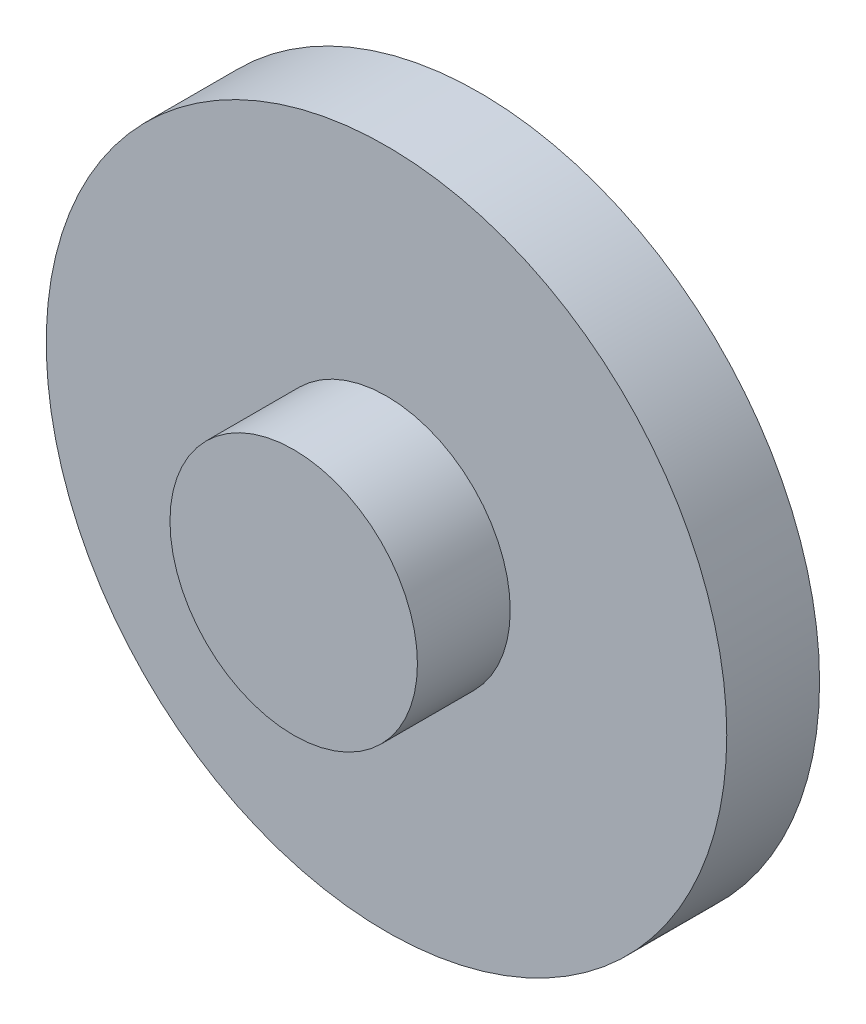
ISO-10303-21;
HEADER;
FILE_DESCRIPTION(('STEP AP214'),'2;1');
FILE_NAME('part.step','',(''),(''),'','','');
FILE_SCHEMA(('AUTOMOTIVE_DESIGN { 1 0 10303 214 1 1 1 1 }'));
ENDSEC;
DATA;
#1=APPLICATION_CONTEXT('core data for automotive mechanical design processes');
#2=APPLICATION_PROTOCOL_DEFINITION('international standard','automotive_design',2000,#1);
#3=PRODUCT_CONTEXT('',#1,'mechanical');
#4=PRODUCT('Part','Part','',(#3));
#5=PRODUCT_RELATED_PRODUCT_CATEGORY('part','',(#4));
#6=PRODUCT_DEFINITION_FORMATION('','',#4);
#7=PRODUCT_DEFINITION_CONTEXT('part definition',#1,'design');
#8=PRODUCT_DEFINITION('design','',#6,#7);
#9=PRODUCT_DEFINITION_SHAPE('','',#8);
#10=(LENGTH_UNIT() NAMED_UNIT(*) SI_UNIT(.MILLI.,.METRE.));
#11=(NAMED_UNIT(*) PLANE_ANGLE_UNIT() SI_UNIT($,.RADIAN.));
#12=(NAMED_UNIT(*) SI_UNIT($,.STERADIAN.) SOLID_ANGLE_UNIT());
#13=UNCERTAINTY_MEASURE_WITH_UNIT(LENGTH_MEASURE(1.E-05),#10,'distance_accuracy_value','');
#14=(GEOMETRIC_REPRESENTATION_CONTEXT(3) GLOBAL_UNCERTAINTY_ASSIGNED_CONTEXT((#13)) GLOBAL_UNIT_ASSIGNED_CONTEXT((#10,
#11,#12)) REPRESENTATION_CONTEXT('',''));
#15=CARTESIAN_POINT('',(0.,0.,0.));
#16=DIRECTION('',(0.,0.,1.));
#17=DIRECTION('',(1.,0.,0.));
#18=AXIS2_PLACEMENT_3D('',#15,#16,#17);
#19=CARTESIAN_POINT('',(0.,0.,3.));
#20=DIRECTION('',(0.,0.,-1.));
#21=DIRECTION('',(-1.,0.,0.));
#22=AXIS2_PLACEMENT_3D('',#19,#20,#21);
#23=CYLINDRICAL_SURFACE('',#22,11.);
#24=CARTESIAN_POINT('',(0.,0.,3.));
#25=DIRECTION('',(0.,0.,1.));
#26=DIRECTION('',(1.,0.,0.));
#27=AXIS2_PLACEMENT_3D('',#24,#25,#26);
#28=CIRCLE('',#27,11.);
#29=CARTESIAN_POINT('',(11.,0.,3.));
#30=VERTEX_POINT('',#29);
#31=EDGE_CURVE('E41',#30,#30,#28,.T.);
#32=ORIENTED_EDGE('',*,*,#31,.F.);
#33=EDGE_LOOP('',(#32));
#34=FACE_BOUND('',#33,.T.);
#35=CARTESIAN_POINT('',(0.,0.,0.));
#36=DIRECTION('',(0.,0.,1.));
#37=DIRECTION('',(1.,0.,0.));
#38=AXIS2_PLACEMENT_3D('',#35,#36,#37);
#39=CIRCLE('',#38,11.);
#40=CARTESIAN_POINT('',(11.,0.,0.));
#41=VERTEX_POINT('',#40);
#42=EDGE_CURVE('E37',#41,#41,#39,.T.);
#43=ORIENTED_EDGE('',*,*,#42,.T.);
#44=EDGE_LOOP('',(#43));
#45=FACE_BOUND('',#44,.T.);
#46=ADVANCED_FACE('F34',(#34,#45),#23,.T.);
#47=CARTESIAN_POINT('',(0.,0.,3.));
#48=DIRECTION('',(0.,0.,1.));
#49=DIRECTION('',(1.,0.,0.));
#50=AXIS2_PLACEMENT_3D('',#47,#48,#49);
#51=PLANE('',#50);
#52=CARTESIAN_POINT('',(0.,0.,3.));
#53=DIRECTION('',(0.,0.,1.));
#54=DIRECTION('',(1.,0.,0.));
#55=AXIS2_PLACEMENT_3D('',#52,#53,#54);
#56=CIRCLE('',#55,4.);
#57=CARTESIAN_POINT('',(4.,0.,3.));
#58=VERTEX_POINT('',#57);
#59=EDGE_CURVE('E10',#58,#58,#56,.T.);
#60=ORIENTED_EDGE('',*,*,#59,.F.);
#61=EDGE_LOOP('',(#60));
#62=FACE_BOUND('',#61,.T.);
#63=ORIENTED_EDGE('',*,*,#31,.T.);
#64=EDGE_LOOP('',(#63));
#65=FACE_BOUND('',#64,.T.);
#66=ADVANCED_FACE('F60',(#62,#65),#51,.T.);
#67=CARTESIAN_POINT('',(0.,0.,0.));
#68=DIRECTION('',(0.,0.,1.));
#69=DIRECTION('',(1.,0.,0.));
#70=AXIS2_PLACEMENT_3D('',#67,#68,#69);
#71=PLANE('',#70);
#72=ORIENTED_EDGE('',*,*,#42,.F.);
#73=EDGE_LOOP('',(#72));
#74=FACE_BOUND('',#73,.T.);
#75=ADVANCED_FACE('F57',(#74),#71,.F.);
#76=CARTESIAN_POINT('',(0.,0.,6.));
#77=DIRECTION('',(0.,0.,-1.));
#78=DIRECTION('',(-1.,0.,0.));
#79=AXIS2_PLACEMENT_3D('',#76,#77,#78);
#80=CYLINDRICAL_SURFACE('',#79,4.);
#81=CARTESIAN_POINT('',(0.,0.,6.));
#82=DIRECTION('',(0.,0.,1.));
#83=DIRECTION('',(1.,0.,0.));
#84=AXIS2_PLACEMENT_3D('',#81,#82,#83);
#85=CIRCLE('',#84,4.);
#86=CARTESIAN_POINT('',(4.,0.,6.));
#87=VERTEX_POINT('',#86);
#88=EDGE_CURVE('E48',#87,#87,#85,.T.);
#89=ORIENTED_EDGE('',*,*,#88,.F.);
#90=EDGE_LOOP('',(#89));
#91=FACE_BOUND('',#90,.T.);
#92=ORIENTED_EDGE('',*,*,#59,.T.);
#93=EDGE_LOOP('',(#92));
#94=FACE_BOUND('',#93,.T.);
#95=ADVANCED_FACE('F59',(#91,#94),#80,.T.);
#96=CARTESIAN_POINT('',(0.,0.,6.));
#97=DIRECTION('',(0.,0.,1.));
#98=DIRECTION('',(1.,0.,0.));
#99=AXIS2_PLACEMENT_3D('',#96,#97,#98);
#100=PLANE('',#99);
#101=ORIENTED_EDGE('',*,*,#88,.T.);
#102=EDGE_LOOP('',(#101));
#103=FACE_BOUND('',#102,.T.);
#104=ADVANCED_FACE('F65',(#103),#100,.T.);
#105=CLOSED_SHELL('',(#46,#66,#75,#95,#104));
#106=MANIFOLD_SOLID_BREP('B2',#105);
#107=ADVANCED_BREP_SHAPE_REPRESENTATION('',(#18,#106),#14);
#108=SHAPE_DEFINITION_REPRESENTATION(#9,#107);
ENDSEC;
END-ISO-10303-21;
